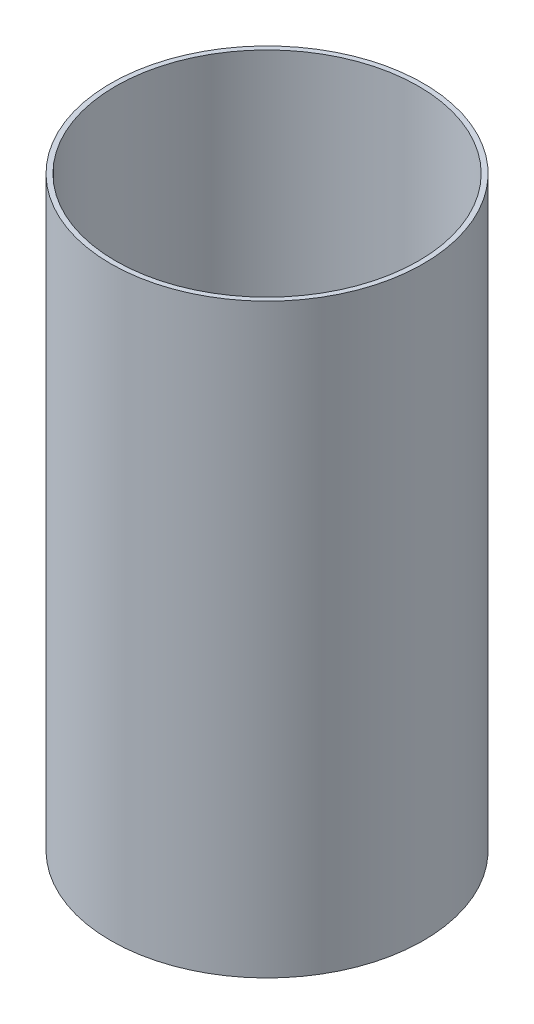
ISO-10303-21;
HEADER;
FILE_DESCRIPTION(('STEP AP214'),'2;1');
FILE_NAME('part.step','',(''),(''),'','','');
FILE_SCHEMA(('AUTOMOTIVE_DESIGN { 1 0 10303 214 1 1 1 1 }'));
ENDSEC;
DATA;
#1=APPLICATION_CONTEXT('core data for automotive mechanical design processes');
#2=APPLICATION_PROTOCOL_DEFINITION('international standard','automotive_design',2000,#1);
#3=PRODUCT_CONTEXT('',#1,'mechanical');
#4=PRODUCT('Part','Part','',(#3));
#5=PRODUCT_RELATED_PRODUCT_CATEGORY('part','',(#4));
#6=PRODUCT_DEFINITION_FORMATION('','',#4);
#7=PRODUCT_DEFINITION_CONTEXT('part definition',#1,'design');
#8=PRODUCT_DEFINITION('design','',#6,#7);
#9=PRODUCT_DEFINITION_SHAPE('','',#8);
#10=(LENGTH_UNIT() NAMED_UNIT(*) SI_UNIT(.MILLI.,.METRE.));
#11=(NAMED_UNIT(*) PLANE_ANGLE_UNIT() SI_UNIT($,.RADIAN.));
#12=(NAMED_UNIT(*) SI_UNIT($,.STERADIAN.) SOLID_ANGLE_UNIT());
#13=UNCERTAINTY_MEASURE_WITH_UNIT(LENGTH_MEASURE(1.E-05),#10,'distance_accuracy_value','');
#14=(GEOMETRIC_REPRESENTATION_CONTEXT(3) GLOBAL_UNCERTAINTY_ASSIGNED_CONTEXT((#13)) GLOBAL_UNIT_ASSIGNED_CONTEXT((#10,
#11,#12)) REPRESENTATION_CONTEXT('',''));
#15=CARTESIAN_POINT('',(0.,0.,0.));
#16=DIRECTION('',(0.,0.,1.));
#17=DIRECTION('',(1.,0.,0.));
#18=AXIS2_PLACEMENT_3D('',#15,#16,#17);
#19=CARTESIAN_POINT('',(0.,381.,0.));
#20=DIRECTION('',(0.,1.,0.));
#21=DIRECTION('',(0.,0.,1.));
#22=AXIS2_PLACEMENT_3D('',#19,#20,#21);
#23=PLANE('',#22);
#24=CARTESIAN_POINT('',(0.,381.,0.));
#25=DIRECTION('',(0.,1.,0.));
#26=DIRECTION('',(0.,0.,1.));
#27=AXIS2_PLACEMENT_3D('',#24,#25,#26);
#28=CIRCLE('',#27,101.6);
#29=CARTESIAN_POINT('',(0.,381.,101.6));
#30=VERTEX_POINT('',#29);
#31=EDGE_CURVE('E10',#30,#30,#28,.T.);
#32=ORIENTED_EDGE('',*,*,#31,.T.);
#33=EDGE_LOOP('',(#32));
#34=FACE_BOUND('',#33,.T.);
#35=CARTESIAN_POINT('',(0.,381.,0.));
#36=DIRECTION('',(0.,1.,0.));
#37=DIRECTION('',(0.,0.,1.));
#38=AXIS2_PLACEMENT_3D('',#35,#36,#37);
#39=CIRCLE('',#38,98.425);
#40=CARTESIAN_POINT('',(0.,381.,98.425));
#41=VERTEX_POINT('',#40);
#42=EDGE_CURVE('E42',#41,#41,#39,.T.);
#43=ORIENTED_EDGE('',*,*,#42,.F.);
#44=EDGE_LOOP('',(#43));
#45=FACE_BOUND('',#44,.T.);
#46=ADVANCED_FACE('F31',(#34,#45),#23,.T.);
#47=CARTESIAN_POINT('',(0.,0.,0.));
#48=DIRECTION('',(0.,1.,0.));
#49=DIRECTION('',(0.,0.,1.));
#50=AXIS2_PLACEMENT_3D('',#47,#48,#49);
#51=PLANE('',#50);
#52=CARTESIAN_POINT('',(0.,0.,0.));
#53=DIRECTION('',(0.,1.,0.));
#54=DIRECTION('',(0.,0.,1.));
#55=AXIS2_PLACEMENT_3D('',#52,#53,#54);
#56=CIRCLE('',#55,101.6);
#57=CARTESIAN_POINT('',(0.,0.,101.6));
#58=VERTEX_POINT('',#57);
#59=EDGE_CURVE('E35',#58,#58,#56,.T.);
#60=ORIENTED_EDGE('',*,*,#59,.F.);
#61=EDGE_LOOP('',(#60));
#62=FACE_BOUND('',#61,.T.);
#63=CARTESIAN_POINT('',(0.,0.,0.));
#64=DIRECTION('',(0.,1.,0.));
#65=DIRECTION('',(0.,0.,1.));
#66=AXIS2_PLACEMENT_3D('',#63,#64,#65);
#67=CIRCLE('',#66,98.425);
#68=CARTESIAN_POINT('',(0.,0.,98.425));
#69=VERTEX_POINT('',#68);
#70=EDGE_CURVE('E44',#69,#69,#67,.T.);
#71=ORIENTED_EDGE('',*,*,#70,.T.);
#72=EDGE_LOOP('',(#71));
#73=FACE_BOUND('',#72,.T.);
#74=ADVANCED_FACE('F54',(#62,#73),#51,.F.);
#75=CARTESIAN_POINT('',(0.,381.,0.));
#76=DIRECTION('',(0.,-1.,0.));
#77=DIRECTION('',(0.,0.,-1.));
#78=AXIS2_PLACEMENT_3D('',#75,#76,#77);
#79=CYLINDRICAL_SURFACE('',#78,101.6);
#80=ORIENTED_EDGE('',*,*,#31,.F.);
#81=EDGE_LOOP('',(#80));
#82=FACE_BOUND('',#81,.T.);
#83=ORIENTED_EDGE('',*,*,#59,.T.);
#84=EDGE_LOOP('',(#83));
#85=FACE_BOUND('',#84,.T.);
#86=ADVANCED_FACE('F33',(#82,#85),#79,.T.);
#87=CARTESIAN_POINT('',(0.,381.,0.));
#88=DIRECTION('',(0.,-1.,0.));
#89=DIRECTION('',(0.,0.,-1.));
#90=AXIS2_PLACEMENT_3D('',#87,#88,#89);
#91=CYLINDRICAL_SURFACE('',#90,98.425);
#92=ORIENTED_EDGE('',*,*,#42,.T.);
#93=EDGE_LOOP('',(#92));
#94=FACE_BOUND('',#93,.T.);
#95=ORIENTED_EDGE('',*,*,#70,.F.);
#96=EDGE_LOOP('',(#95));
#97=FACE_BOUND('',#96,.T.);
#98=ADVANCED_FACE('F50',(#94,#97),#91,.F.);
#99=CLOSED_SHELL('',(#46,#74,#86,#98));
#100=MANIFOLD_SOLID_BREP('B2',#99);
#101=ADVANCED_BREP_SHAPE_REPRESENTATION('',(#18,#100),#14);
#102=SHAPE_DEFINITION_REPRESENTATION(#9,#101);
ENDSEC;
END-ISO-10303-21;
